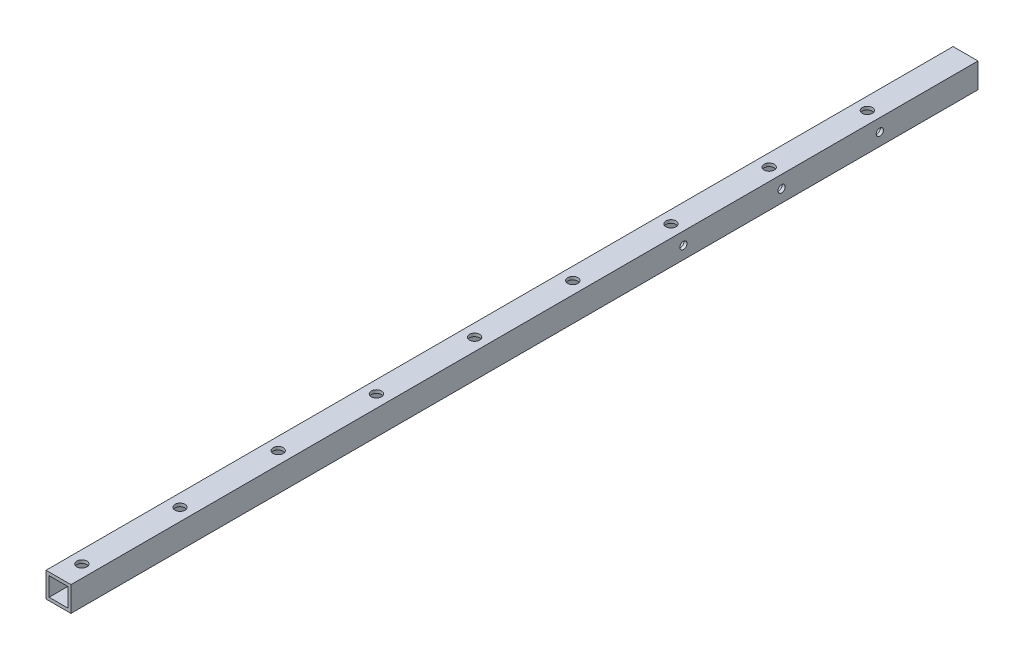
ISO-10303-21;
HEADER;
FILE_DESCRIPTION(('STEP AP214'),'2;1');
FILE_NAME('part.step','',(''),(''),'','','');
FILE_SCHEMA(('AUTOMOTIVE_DESIGN { 1 0 10303 214 1 1 1 1 }'));
ENDSEC;
DATA;
#1=APPLICATION_CONTEXT('core data for automotive mechanical design processes');
#2=APPLICATION_PROTOCOL_DEFINITION('international standard','automotive_design',2000,#1);
#3=PRODUCT_CONTEXT('',#1,'mechanical');
#4=PRODUCT('Part','Part','',(#3));
#5=PRODUCT_RELATED_PRODUCT_CATEGORY('part','',(#4));
#6=PRODUCT_DEFINITION_FORMATION('','',#4);
#7=PRODUCT_DEFINITION_CONTEXT('part definition',#1,'design');
#8=PRODUCT_DEFINITION('design','',#6,#7);
#9=PRODUCT_DEFINITION_SHAPE('','',#8);
#10=(LENGTH_UNIT() NAMED_UNIT(*) SI_UNIT(.MILLI.,.METRE.));
#11=(NAMED_UNIT(*) PLANE_ANGLE_UNIT() SI_UNIT($,.RADIAN.));
#12=(NAMED_UNIT(*) SI_UNIT($,.STERADIAN.) SOLID_ANGLE_UNIT());
#13=UNCERTAINTY_MEASURE_WITH_UNIT(LENGTH_MEASURE(1.E-05),#10,'distance_accuracy_value','');
#14=(GEOMETRIC_REPRESENTATION_CONTEXT(3) GLOBAL_UNCERTAINTY_ASSIGNED_CONTEXT((#13)) GLOBAL_UNIT_ASSIGNED_CONTEXT((#10,
#11,#12)) REPRESENTATION_CONTEXT('',''));
#15=CARTESIAN_POINT('',(0.,0.,0.));
#16=DIRECTION('',(0.,0.,1.));
#17=DIRECTION('',(1.,0.,0.));
#18=AXIS2_PLACEMENT_3D('',#15,#16,#17);
#19=CARTESIAN_POINT('',(-12.7,-12.7,923.8));
#20=DIRECTION('',(0.,0.,1.));
#21=DIRECTION('',(1.,0.,0.));
#22=AXIS2_PLACEMENT_3D('',#19,#20,#21);
#23=PLANE('',#22);
#24=DIRECTION('',(0.,-1.,0.));
#25=VECTOR('',#24,1.);
#26=CARTESIAN_POINT('',(-12.7,12.7,923.8));
#27=LINE('',#26,#25);
#28=CARTESIAN_POINT('',(-12.7,12.7,923.8));
#29=VERTEX_POINT('',#28);
#30=CARTESIAN_POINT('',(-12.7,-12.7,923.8));
#31=VERTEX_POINT('',#30);
#32=EDGE_CURVE('E138',#29,#31,#27,.T.);
#33=ORIENTED_EDGE('',*,*,#32,.T.);
#34=DIRECTION('',(1.,0.,0.));
#35=VECTOR('',#34,1.);
#36=CARTESIAN_POINT('',(-12.7,-12.7,923.8));
#37=LINE('',#36,#35);
#38=CARTESIAN_POINT('',(12.7,-12.7,923.8));
#39=VERTEX_POINT('',#38);
#40=EDGE_CURVE('E141',#31,#39,#37,.T.);
#41=ORIENTED_EDGE('',*,*,#40,.T.);
#42=DIRECTION('',(0.,1.,0.));
#43=VECTOR('',#42,1.);
#44=CARTESIAN_POINT('',(12.7,12.7,923.8));
#45=LINE('',#44,#43);
#46=CARTESIAN_POINT('',(12.7,12.7,923.8));
#47=VERTEX_POINT('',#46);
#48=EDGE_CURVE('E144',#39,#47,#45,.T.);
#49=ORIENTED_EDGE('',*,*,#48,.T.);
#50=DIRECTION('',(-1.,0.,0.));
#51=VECTOR('',#50,1.);
#52=CARTESIAN_POINT('',(-12.7,12.7,923.8));
#53=LINE('',#52,#51);
#54=EDGE_CURVE('E146',#47,#29,#53,.T.);
#55=ORIENTED_EDGE('',*,*,#54,.T.);
#56=EDGE_LOOP('',(#33,#41,#49,#55));
#57=FACE_BOUND('',#56,.T.);
#58=DIRECTION('',(1.,0.,0.));
#59=VECTOR('',#58,1.);
#60=CARTESIAN_POINT('',(-9.525,-9.525,923.8));
#61=LINE('',#60,#59);
#62=CARTESIAN_POINT('',(-9.525,-9.525,923.8));
#63=VERTEX_POINT('',#62);
#64=CARTESIAN_POINT('',(9.525,-9.525,923.8));
#65=VERTEX_POINT('',#64);
#66=EDGE_CURVE('E108',#63,#65,#61,.T.);
#67=ORIENTED_EDGE('',*,*,#66,.F.);
#68=DIRECTION('',(0.,-1.,0.));
#69=VECTOR('',#68,1.);
#70=CARTESIAN_POINT('',(-9.525,9.525,923.8));
#71=LINE('',#70,#69);
#72=CARTESIAN_POINT('',(-9.525,9.525,923.8));
#73=VERTEX_POINT('',#72);
#74=EDGE_CURVE('E100',#73,#63,#71,.T.);
#75=ORIENTED_EDGE('',*,*,#74,.F.);
#76=DIRECTION('',(-1.,0.,0.));
#77=VECTOR('',#76,1.);
#78=CARTESIAN_POINT('',(-9.525,9.525,923.8));
#79=LINE('',#78,#77);
#80=CARTESIAN_POINT('',(9.525,9.525,923.8));
#81=VERTEX_POINT('',#80);
#82=EDGE_CURVE('E122',#81,#73,#79,.T.);
#83=ORIENTED_EDGE('',*,*,#82,.F.);
#84=DIRECTION('',(0.,1.,0.));
#85=VECTOR('',#84,1.);
#86=CARTESIAN_POINT('',(9.525,9.525,923.8));
#87=LINE('',#86,#85);
#88=EDGE_CURVE('E120',#65,#81,#87,.T.);
#89=ORIENTED_EDGE('',*,*,#88,.F.);
#90=EDGE_LOOP('',(#67,#75,#83,#89));
#91=FACE_BOUND('',#90,.T.);
#92=ADVANCED_FACE('F33',(#57,#91),#23,.T.);
#93=CARTESIAN_POINT('',(-12.7,-12.7,0.));
#94=DIRECTION('',(0.,0.,1.));
#95=DIRECTION('',(1.,0.,0.));
#96=AXIS2_PLACEMENT_3D('',#93,#94,#95);
#97=PLANE('',#96);
#98=DIRECTION('',(0.,-1.,0.));
#99=VECTOR('',#98,1.);
#100=CARTESIAN_POINT('',(-12.7,12.7,0.));
#101=LINE('',#100,#99);
#102=CARTESIAN_POINT('',(-12.7,12.7,0.));
#103=VERTEX_POINT('',#102);
#104=CARTESIAN_POINT('',(-12.7,-12.7,0.));
#105=VERTEX_POINT('',#104);
#106=EDGE_CURVE('E116',#103,#105,#101,.T.);
#107=ORIENTED_EDGE('',*,*,#106,.F.);
#108=DIRECTION('',(-1.,0.,0.));
#109=VECTOR('',#108,1.);
#110=CARTESIAN_POINT('',(-12.7,12.7,0.));
#111=LINE('',#110,#109);
#112=CARTESIAN_POINT('',(12.7,12.7,0.));
#113=VERTEX_POINT('',#112);
#114=EDGE_CURVE('E142',#113,#103,#111,.T.);
#115=ORIENTED_EDGE('',*,*,#114,.F.);
#116=DIRECTION('',(0.,1.,0.));
#117=VECTOR('',#116,1.);
#118=CARTESIAN_POINT('',(12.7,12.7,0.));
#119=LINE('',#118,#117);
#120=CARTESIAN_POINT('',(12.7,-12.7,0.));
#121=VERTEX_POINT('',#120);
#122=EDGE_CURVE('E153',#121,#113,#119,.T.);
#123=ORIENTED_EDGE('',*,*,#122,.F.);
#124=DIRECTION('',(1.,0.,0.));
#125=VECTOR('',#124,1.);
#126=CARTESIAN_POINT('',(-12.7,-12.7,0.));
#127=LINE('',#126,#125);
#128=EDGE_CURVE('E151',#105,#121,#127,.T.);
#129=ORIENTED_EDGE('',*,*,#128,.F.);
#130=EDGE_LOOP('',(#107,#115,#123,#129));
#131=FACE_BOUND('',#130,.T.);
#132=DIRECTION('',(0.,-1.,0.));
#133=VECTOR('',#132,1.);
#134=CARTESIAN_POINT('',(-9.525,9.525,0.));
#135=LINE('',#134,#133);
#136=CARTESIAN_POINT('',(-9.525,9.525,0.));
#137=VERTEX_POINT('',#136);
#138=CARTESIAN_POINT('',(-9.525,-9.525,0.));
#139=VERTEX_POINT('',#138);
#140=EDGE_CURVE('E58',#137,#139,#135,.T.);
#141=ORIENTED_EDGE('',*,*,#140,.T.);
#142=DIRECTION('',(1.,0.,0.));
#143=VECTOR('',#142,1.);
#144=CARTESIAN_POINT('',(-9.525,-9.525,0.));
#145=LINE('',#144,#143);
#146=CARTESIAN_POINT('',(9.525,-9.525,0.));
#147=VERTEX_POINT('',#146);
#148=EDGE_CURVE('E115',#139,#147,#145,.T.);
#149=ORIENTED_EDGE('',*,*,#148,.T.);
#150=DIRECTION('',(0.,1.,0.));
#151=VECTOR('',#150,1.);
#152=CARTESIAN_POINT('',(9.525,9.525,0.));
#153=LINE('',#152,#151);
#154=CARTESIAN_POINT('',(9.525,9.525,0.));
#155=VERTEX_POINT('',#154);
#156=EDGE_CURVE('E130',#147,#155,#153,.T.);
#157=ORIENTED_EDGE('',*,*,#156,.T.);
#158=DIRECTION('',(-1.,0.,0.));
#159=VECTOR('',#158,1.);
#160=CARTESIAN_POINT('',(-9.525,9.525,0.));
#161=LINE('',#160,#159);
#162=EDGE_CURVE('E109',#155,#137,#161,.T.);
#163=ORIENTED_EDGE('',*,*,#162,.T.);
#164=EDGE_LOOP('',(#141,#149,#157,#163));
#165=FACE_BOUND('',#164,.T.);
#166=ADVANCED_FACE('F320',(#131,#165),#97,.F.);
#167=CARTESIAN_POINT('',(-12.7,12.7,923.8));
#168=DIRECTION('',(1.,0.,0.));
#169=DIRECTION('',(0.,1.,0.));
#170=AXIS2_PLACEMENT_3D('',#167,#168,#169);
#171=PLANE('',#170);
#172=CARTESIAN_POINT('',(-12.7,0.,300.));
#173=DIRECTION('',(-1.,0.,0.));
#174=DIRECTION('',(0.,-1.,0.));
#175=AXIS2_PLACEMENT_3D('',#172,#173,#174);
#176=CIRCLE('',#175,3.675);
#177=CARTESIAN_POINT('',(-12.7,-3.675,300.));
#178=VERTEX_POINT('',#177);
#179=EDGE_CURVE('E452',#178,#178,#176,.T.);
#180=ORIENTED_EDGE('',*,*,#179,.F.);
#181=EDGE_LOOP('',(#180));
#182=FACE_BOUND('',#181,.T.);
#183=CARTESIAN_POINT('',(-12.7,0.,200.));
#184=DIRECTION('',(-1.,0.,0.));
#185=DIRECTION('',(0.,-1.,0.));
#186=AXIS2_PLACEMENT_3D('',#183,#184,#185);
#187=CIRCLE('',#186,3.675);
#188=CARTESIAN_POINT('',(-12.7,-3.675,200.));
#189=VERTEX_POINT('',#188);
#190=EDGE_CURVE('E221',#189,#189,#187,.T.);
#191=ORIENTED_EDGE('',*,*,#190,.F.);
#192=EDGE_LOOP('',(#191));
#193=FACE_BOUND('',#192,.T.);
#194=CARTESIAN_POINT('',(-12.7,0.,100.));
#195=DIRECTION('',(-1.,0.,0.));
#196=DIRECTION('',(0.,-1.,0.));
#197=AXIS2_PLACEMENT_3D('',#194,#195,#196);
#198=CIRCLE('',#197,3.675);
#199=CARTESIAN_POINT('',(-12.7,-3.675,100.));
#200=VERTEX_POINT('',#199);
#201=EDGE_CURVE('E218',#200,#200,#198,.T.);
#202=ORIENTED_EDGE('',*,*,#201,.F.);
#203=EDGE_LOOP('',(#202));
#204=FACE_BOUND('',#203,.T.);
#205=ORIENTED_EDGE('',*,*,#106,.T.);
#206=DIRECTION('',(0.,0.,-1.));
#207=VECTOR('',#206,1.);
#208=CARTESIAN_POINT('',(-12.7,-12.7,923.8));
#209=LINE('',#208,#207);
#210=EDGE_CURVE('E11',#31,#105,#209,.T.);
#211=ORIENTED_EDGE('',*,*,#210,.F.);
#212=ORIENTED_EDGE('',*,*,#32,.F.);
#213=DIRECTION('',(0.,0.,-1.));
#214=VECTOR('',#213,1.);
#215=CARTESIAN_POINT('',(-12.7,12.7,923.8));
#216=LINE('',#215,#214);
#217=EDGE_CURVE('E148',#29,#103,#216,.T.);
#218=ORIENTED_EDGE('',*,*,#217,.T.);
#219=EDGE_LOOP('',(#205,#211,#212,#218));
#220=FACE_BOUND('',#219,.T.);
#221=ADVANCED_FACE('F35',(#182,#193,#204,#220),#171,.F.);
#222=CARTESIAN_POINT('',(-12.7,-12.7,923.8));
#223=DIRECTION('',(0.,1.,0.));
#224=DIRECTION('',(0.,0.,1.));
#225=AXIS2_PLACEMENT_3D('',#222,#223,#224);
#226=PLANE('',#225);
#227=CARTESIAN_POINT('',(8.37955521322352E-12,-12.7,900.));
#228=DIRECTION('',(0.,1.,0.));
#229=DIRECTION('',(0.,0.,1.));
#230=AXIS2_PLACEMENT_3D('',#227,#228,#229);
#231=CIRCLE('',#230,5.175);
#232=CARTESIAN_POINT('',(8.37955521322352E-12,-12.7,905.175));
#233=VERTEX_POINT('',#232);
#234=EDGE_CURVE('E206',#233,#233,#231,.T.);
#235=ORIENTED_EDGE('',*,*,#234,.T.);
#236=EDGE_LOOP('',(#235));
#237=FACE_BOUND('',#236,.T.);
#238=CARTESIAN_POINT('',(7.33211081157058E-12,-12.7,800.));
#239=DIRECTION('',(0.,1.,0.));
#240=DIRECTION('',(0.,0.,1.));
#241=AXIS2_PLACEMENT_3D('',#238,#239,#240);
#242=CIRCLE('',#241,5.175);
#243=CARTESIAN_POINT('',(7.33211081157058E-12,-12.7,805.175));
#244=VERTEX_POINT('',#243);
#245=EDGE_CURVE('E201',#244,#244,#242,.T.);
#246=ORIENTED_EDGE('',*,*,#245,.T.);
#247=EDGE_LOOP('',(#246));
#248=FACE_BOUND('',#247,.T.);
#249=CARTESIAN_POINT('',(6.28466640991764E-12,-12.7,700.));
#250=DIRECTION('',(0.,1.,0.));
#251=DIRECTION('',(0.,0.,1.));
#252=AXIS2_PLACEMENT_3D('',#249,#250,#251);
#253=CIRCLE('',#252,5.175);
#254=CARTESIAN_POINT('',(6.28466640991764E-12,-12.7,705.175));
#255=VERTEX_POINT('',#254);
#256=EDGE_CURVE('E196',#255,#255,#253,.T.);
#257=ORIENTED_EDGE('',*,*,#256,.T.);
#258=EDGE_LOOP('',(#257));
#259=FACE_BOUND('',#258,.T.);
#260=CARTESIAN_POINT('',(5.2372220082647E-12,-12.7,600.));
#261=DIRECTION('',(0.,1.,0.));
#262=DIRECTION('',(0.,0.,1.));
#263=AXIS2_PLACEMENT_3D('',#260,#261,#262);
#264=CIRCLE('',#263,5.175);
#265=CARTESIAN_POINT('',(5.2372220082647E-12,-12.7,605.175));
#266=VERTEX_POINT('',#265);
#267=EDGE_CURVE('E191',#266,#266,#264,.T.);
#268=ORIENTED_EDGE('',*,*,#267,.T.);
#269=EDGE_LOOP('',(#268));
#270=FACE_BOUND('',#269,.T.);
#271=CARTESIAN_POINT('',(4.18977760661176E-12,-12.7,500.));
#272=DIRECTION('',(0.,1.,0.));
#273=DIRECTION('',(0.,0.,1.));
#274=AXIS2_PLACEMENT_3D('',#271,#272,#273);
#275=CIRCLE('',#274,5.175);
#276=CARTESIAN_POINT('',(4.18977760661176E-12,-12.7,505.175));
#277=VERTEX_POINT('',#276);
#278=EDGE_CURVE('E186',#277,#277,#275,.T.);
#279=ORIENTED_EDGE('',*,*,#278,.T.);
#280=EDGE_LOOP('',(#279));
#281=FACE_BOUND('',#280,.T.);
#282=CARTESIAN_POINT('',(3.14233320495882E-12,-12.7,400.));
#283=DIRECTION('',(0.,1.,0.));
#284=DIRECTION('',(0.,0.,1.));
#285=AXIS2_PLACEMENT_3D('',#282,#283,#284);
#286=CIRCLE('',#285,5.175);
#287=CARTESIAN_POINT('',(3.14233320495882E-12,-12.7,405.175));
#288=VERTEX_POINT('',#287);
#289=EDGE_CURVE('E181',#288,#288,#286,.T.);
#290=ORIENTED_EDGE('',*,*,#289,.T.);
#291=EDGE_LOOP('',(#290));
#292=FACE_BOUND('',#291,.T.);
#293=CARTESIAN_POINT('',(2.09488880330588E-12,-12.7,300.));
#294=DIRECTION('',(0.,1.,0.));
#295=DIRECTION('',(0.,0.,1.));
#296=AXIS2_PLACEMENT_3D('',#293,#294,#295);
#297=CIRCLE('',#296,5.175);
#298=CARTESIAN_POINT('',(2.09488880330588E-12,-12.7,305.175));
#299=VERTEX_POINT('',#298);
#300=EDGE_CURVE('E176',#299,#299,#297,.T.);
#301=ORIENTED_EDGE('',*,*,#300,.T.);
#302=EDGE_LOOP('',(#301));
#303=FACE_BOUND('',#302,.T.);
#304=CARTESIAN_POINT('',(1.04744440165294E-12,-12.7,200.));
#305=DIRECTION('',(0.,1.,0.));
#306=DIRECTION('',(0.,0.,1.));
#307=AXIS2_PLACEMENT_3D('',#304,#305,#306);
#308=CIRCLE('',#307,5.175);
#309=CARTESIAN_POINT('',(1.04744440165294E-12,-12.7,205.175));
#310=VERTEX_POINT('',#309);
#311=EDGE_CURVE('E171',#310,#310,#308,.T.);
#312=ORIENTED_EDGE('',*,*,#311,.T.);
#313=EDGE_LOOP('',(#312));
#314=FACE_BOUND('',#313,.T.);
#315=CARTESIAN_POINT('',(0.,-12.7,100.));
#316=DIRECTION('',(0.,1.,0.));
#317=DIRECTION('',(0.,0.,1.));
#318=AXIS2_PLACEMENT_3D('',#315,#316,#317);
#319=CIRCLE('',#318,5.175);
#320=CARTESIAN_POINT('',(0.,-12.7,105.175));
#321=VERTEX_POINT('',#320);
#322=EDGE_CURVE('E166',#321,#321,#319,.T.);
#323=ORIENTED_EDGE('',*,*,#322,.T.);
#324=EDGE_LOOP('',(#323));
#325=FACE_BOUND('',#324,.T.);
#326=ORIENTED_EDGE('',*,*,#128,.T.);
#327=DIRECTION('',(0.,0.,-1.));
#328=VECTOR('',#327,1.);
#329=CARTESIAN_POINT('',(12.7,-12.7,923.8));
#330=LINE('',#329,#328);
#331=EDGE_CURVE('E42',#39,#121,#330,.T.);
#332=ORIENTED_EDGE('',*,*,#331,.F.);
#333=ORIENTED_EDGE('',*,*,#40,.F.);
#334=ORIENTED_EDGE('',*,*,#210,.T.);
#335=EDGE_LOOP('',(#326,#332,#333,#334));
#336=FACE_BOUND('',#335,.T.);
#337=ADVANCED_FACE('F334',(#237,#248,#259,#270,#281,#292,#303,#314,#325,#336),#226,.F.);
#338=CARTESIAN_POINT('',(12.7,12.7,923.8));
#339=DIRECTION('',(-1.,0.,0.));
#340=DIRECTION('',(0.,-1.,0.));
#341=AXIS2_PLACEMENT_3D('',#338,#339,#340);
#342=PLANE('',#341);
#343=CARTESIAN_POINT('',(12.7,0.,300.));
#344=DIRECTION('',(-1.,0.,0.));
#345=DIRECTION('',(0.,-1.,0.));
#346=AXIS2_PLACEMENT_3D('',#343,#344,#345);
#347=CIRCLE('',#346,3.675);
#348=CARTESIAN_POINT('',(12.7,-3.67499999999999,300.));
#349=VERTEX_POINT('',#348);
#350=EDGE_CURVE('E451',#349,#349,#347,.T.);
#351=ORIENTED_EDGE('',*,*,#350,.T.);
#352=EDGE_LOOP('',(#351));
#353=FACE_BOUND('',#352,.T.);
#354=CARTESIAN_POINT('',(12.7,0.,200.));
#355=DIRECTION('',(-1.,0.,0.));
#356=DIRECTION('',(0.,-1.,0.));
#357=AXIS2_PLACEMENT_3D('',#354,#355,#356);
#358=CIRCLE('',#357,3.675);
#359=CARTESIAN_POINT('',(12.7,-3.67499999999999,200.));
#360=VERTEX_POINT('',#359);
#361=EDGE_CURVE('E214',#360,#360,#358,.T.);
#362=ORIENTED_EDGE('',*,*,#361,.T.);
#363=EDGE_LOOP('',(#362));
#364=FACE_BOUND('',#363,.T.);
#365=CARTESIAN_POINT('',(12.7,0.,100.));
#366=DIRECTION('',(-1.,0.,0.));
#367=DIRECTION('',(0.,-1.,0.));
#368=AXIS2_PLACEMENT_3D('',#365,#366,#367);
#369=CIRCLE('',#368,3.675);
#370=CARTESIAN_POINT('',(12.7,-3.67499999999999,100.));
#371=VERTEX_POINT('',#370);
#372=EDGE_CURVE('E210',#371,#371,#369,.T.);
#373=ORIENTED_EDGE('',*,*,#372,.T.);
#374=EDGE_LOOP('',(#373));
#375=FACE_BOUND('',#374,.T.);
#376=ORIENTED_EDGE('',*,*,#122,.T.);
#377=DIRECTION('',(0.,0.,-1.));
#378=VECTOR('',#377,1.);
#379=CARTESIAN_POINT('',(12.7,12.7,923.8));
#380=LINE('',#379,#378);
#381=EDGE_CURVE('E158',#47,#113,#380,.T.);
#382=ORIENTED_EDGE('',*,*,#381,.F.);
#383=ORIENTED_EDGE('',*,*,#48,.F.);
#384=ORIENTED_EDGE('',*,*,#331,.T.);
#385=EDGE_LOOP('',(#376,#382,#383,#384));
#386=FACE_BOUND('',#385,.T.);
#387=ADVANCED_FACE('F331',(#353,#364,#375,#386),#342,.F.);
#388=CARTESIAN_POINT('',(-12.7,12.7,923.8));
#389=DIRECTION('',(0.,-1.,0.));
#390=DIRECTION('',(0.,0.,-1.));
#391=AXIS2_PLACEMENT_3D('',#388,#389,#390);
#392=PLANE('',#391);
#393=CARTESIAN_POINT('',(8.37955521322352E-12,12.7,900.));
#394=DIRECTION('',(0.,1.,0.));
#395=DIRECTION('',(0.,0.,1.));
#396=AXIS2_PLACEMENT_3D('',#393,#394,#395);
#397=CIRCLE('',#396,5.175);
#398=CARTESIAN_POINT('',(8.37955521322352E-12,12.7,905.175));
#399=VERTEX_POINT('',#398);
#400=EDGE_CURVE('E237',#399,#399,#397,.T.);
#401=ORIENTED_EDGE('',*,*,#400,.F.);
#402=EDGE_LOOP('',(#401));
#403=FACE_BOUND('',#402,.T.);
#404=CARTESIAN_POINT('',(7.33211081157058E-12,12.7,800.));
#405=DIRECTION('',(0.,1.,0.));
#406=DIRECTION('',(0.,0.,1.));
#407=AXIS2_PLACEMENT_3D('',#404,#405,#406);
#408=CIRCLE('',#407,5.175);
#409=CARTESIAN_POINT('',(7.33211081157058E-12,12.7,805.175));
#410=VERTEX_POINT('',#409);
#411=EDGE_CURVE('E244',#410,#410,#408,.T.);
#412=ORIENTED_EDGE('',*,*,#411,.F.);
#413=EDGE_LOOP('',(#412));
#414=FACE_BOUND('',#413,.T.);
#415=CARTESIAN_POINT('',(6.28466640991764E-12,12.7,700.));
#416=DIRECTION('',(0.,1.,0.));
#417=DIRECTION('',(0.,0.,1.));
#418=AXIS2_PLACEMENT_3D('',#415,#416,#417);
#419=CIRCLE('',#418,5.175);
#420=CARTESIAN_POINT('',(6.28466640991764E-12,12.7,705.175));
#421=VERTEX_POINT('',#420);
#422=EDGE_CURVE('E251',#421,#421,#419,.T.);
#423=ORIENTED_EDGE('',*,*,#422,.F.);
#424=EDGE_LOOP('',(#423));
#425=FACE_BOUND('',#424,.T.);
#426=CARTESIAN_POINT('',(5.2372220082647E-12,12.7,600.));
#427=DIRECTION('',(0.,1.,0.));
#428=DIRECTION('',(0.,0.,1.));
#429=AXIS2_PLACEMENT_3D('',#426,#427,#428);
#430=CIRCLE('',#429,5.175);
#431=CARTESIAN_POINT('',(5.2372220082647E-12,12.7,605.175));
#432=VERTEX_POINT('',#431);
#433=EDGE_CURVE('E258',#432,#432,#430,.T.);
#434=ORIENTED_EDGE('',*,*,#433,.F.);
#435=EDGE_LOOP('',(#434));
#436=FACE_BOUND('',#435,.T.);
#437=CARTESIAN_POINT('',(4.18977760661176E-12,12.7,500.));
#438=DIRECTION('',(0.,1.,0.));
#439=DIRECTION('',(0.,0.,1.));
#440=AXIS2_PLACEMENT_3D('',#437,#438,#439);
#441=CIRCLE('',#440,5.175);
#442=CARTESIAN_POINT('',(4.18977760661176E-12,12.7,505.175));
#443=VERTEX_POINT('',#442);
#444=EDGE_CURVE('E265',#443,#443,#441,.T.);
#445=ORIENTED_EDGE('',*,*,#444,.F.);
#446=EDGE_LOOP('',(#445));
#447=FACE_BOUND('',#446,.T.);
#448=CARTESIAN_POINT('',(3.14233320495882E-12,12.7,400.));
#449=DIRECTION('',(0.,1.,0.));
#450=DIRECTION('',(0.,0.,1.));
#451=AXIS2_PLACEMENT_3D('',#448,#449,#450);
#452=CIRCLE('',#451,5.175);
#453=CARTESIAN_POINT('',(3.14233320495882E-12,12.7,405.175));
#454=VERTEX_POINT('',#453);
#455=EDGE_CURVE('E272',#454,#454,#452,.T.);
#456=ORIENTED_EDGE('',*,*,#455,.F.);
#457=EDGE_LOOP('',(#456));
#458=FACE_BOUND('',#457,.T.);
#459=CARTESIAN_POINT('',(2.09488880330588E-12,12.7,300.));
#460=DIRECTION('',(0.,1.,0.));
#461=DIRECTION('',(0.,0.,1.));
#462=AXIS2_PLACEMENT_3D('',#459,#460,#461);
#463=CIRCLE('',#462,5.175);
#464=CARTESIAN_POINT('',(2.09488880330588E-12,12.7,305.175));
#465=VERTEX_POINT('',#464);
#466=EDGE_CURVE('E279',#465,#465,#463,.T.);
#467=ORIENTED_EDGE('',*,*,#466,.F.);
#468=EDGE_LOOP('',(#467));
#469=FACE_BOUND('',#468,.T.);
#470=CARTESIAN_POINT('',(1.04744440165294E-12,12.7,200.));
#471=DIRECTION('',(0.,1.,0.));
#472=DIRECTION('',(0.,0.,1.));
#473=AXIS2_PLACEMENT_3D('',#470,#471,#472);
#474=CIRCLE('',#473,5.175);
#475=CARTESIAN_POINT('',(1.04744440165294E-12,12.7,205.175));
#476=VERTEX_POINT('',#475);
#477=EDGE_CURVE('E286',#476,#476,#474,.T.);
#478=ORIENTED_EDGE('',*,*,#477,.F.);
#479=EDGE_LOOP('',(#478));
#480=FACE_BOUND('',#479,.T.);
#481=CARTESIAN_POINT('',(0.,12.7,100.));
#482=DIRECTION('',(0.,1.,0.));
#483=DIRECTION('',(0.,0.,1.));
#484=AXIS2_PLACEMENT_3D('',#481,#482,#483);
#485=CIRCLE('',#484,5.175);
#486=CARTESIAN_POINT('',(0.,12.7,105.175));
#487=VERTEX_POINT('',#486);
#488=EDGE_CURVE('E293',#487,#487,#485,.T.);
#489=ORIENTED_EDGE('',*,*,#488,.F.);
#490=EDGE_LOOP('',(#489));
#491=FACE_BOUND('',#490,.T.);
#492=ORIENTED_EDGE('',*,*,#114,.T.);
#493=ORIENTED_EDGE('',*,*,#217,.F.);
#494=ORIENTED_EDGE('',*,*,#54,.F.);
#495=ORIENTED_EDGE('',*,*,#381,.T.);
#496=EDGE_LOOP('',(#492,#493,#494,#495));
#497=FACE_BOUND('',#496,.T.);
#498=ADVANCED_FACE('F314',(#403,#414,#425,#436,#447,#458,#469,#480,#491,#497),#392,.F.);
#499=CARTESIAN_POINT('',(-9.525,9.525,923.8));
#500=DIRECTION('',(1.,0.,0.));
#501=DIRECTION('',(0.,1.,0.));
#502=AXIS2_PLACEMENT_3D('',#499,#500,#501);
#503=PLANE('',#502);
#504=CARTESIAN_POINT('',(-9.525,0.,300.));
#505=DIRECTION('',(1.,0.,0.));
#506=DIRECTION('',(0.,1.,0.));
#507=AXIS2_PLACEMENT_3D('',#504,#505,#506);
#508=CIRCLE('',#507,3.675);
#509=CARTESIAN_POINT('',(-9.525,3.675,300.));
#510=VERTEX_POINT('',#509);
#511=EDGE_CURVE('E226',#510,#510,#508,.T.);
#512=ORIENTED_EDGE('',*,*,#511,.F.);
#513=EDGE_LOOP('',(#512));
#514=FACE_BOUND('',#513,.T.);
#515=CARTESIAN_POINT('',(-9.525,0.,200.));
#516=DIRECTION('',(1.,0.,0.));
#517=DIRECTION('',(0.,1.,0.));
#518=AXIS2_PLACEMENT_3D('',#515,#516,#517);
#519=CIRCLE('',#518,3.675);
#520=CARTESIAN_POINT('',(-9.525,3.675,200.));
#521=VERTEX_POINT('',#520);
#522=EDGE_CURVE('E213',#521,#521,#519,.T.);
#523=ORIENTED_EDGE('',*,*,#522,.F.);
#524=EDGE_LOOP('',(#523));
#525=FACE_BOUND('',#524,.T.);
#526=CARTESIAN_POINT('',(-9.525,0.,100.));
#527=DIRECTION('',(1.,0.,0.));
#528=DIRECTION('',(0.,1.,0.));
#529=AXIS2_PLACEMENT_3D('',#526,#527,#528);
#530=CIRCLE('',#529,3.675);
#531=CARTESIAN_POINT('',(-9.525,3.675,100.));
#532=VERTEX_POINT('',#531);
#533=EDGE_CURVE('E209',#532,#532,#530,.T.);
#534=ORIENTED_EDGE('',*,*,#533,.F.);
#535=EDGE_LOOP('',(#534));
#536=FACE_BOUND('',#535,.T.);
#537=ORIENTED_EDGE('',*,*,#140,.F.);
#538=DIRECTION('',(0.,0.,-1.));
#539=VECTOR('',#538,1.);
#540=CARTESIAN_POINT('',(-9.525,9.525,923.8));
#541=LINE('',#540,#539);
#542=EDGE_CURVE('E104',#73,#137,#541,.T.);
#543=ORIENTED_EDGE('',*,*,#542,.F.);
#544=ORIENTED_EDGE('',*,*,#74,.T.);
#545=DIRECTION('',(0.,0.,-1.));
#546=VECTOR('',#545,1.);
#547=CARTESIAN_POINT('',(-9.525,-9.525,923.8));
#548=LINE('',#547,#546);
#549=EDGE_CURVE('E103',#63,#139,#548,.T.);
#550=ORIENTED_EDGE('',*,*,#549,.T.);
#551=EDGE_LOOP('',(#537,#543,#544,#550));
#552=FACE_BOUND('',#551,.T.);
#553=ADVANCED_FACE('F102',(#514,#525,#536,#552),#503,.T.);
#554=CARTESIAN_POINT('',(-9.525,-9.525,923.8));
#555=DIRECTION('',(0.,1.,0.));
#556=DIRECTION('',(0.,0.,1.));
#557=AXIS2_PLACEMENT_3D('',#554,#555,#556);
#558=PLANE('',#557);
#559=CARTESIAN_POINT('',(8.37955521322352E-12,-9.525,900.));
#560=DIRECTION('',(0.,1.,0.));
#561=DIRECTION('',(0.,0.,1.));
#562=AXIS2_PLACEMENT_3D('',#559,#560,#561);
#563=CIRCLE('',#562,5.175);
#564=CARTESIAN_POINT('',(8.37955521322352E-12,-9.525,905.175));
#565=VERTEX_POINT('',#564);
#566=EDGE_CURVE('E205',#565,#565,#563,.T.);
#567=ORIENTED_EDGE('',*,*,#566,.F.);
#568=EDGE_LOOP('',(#567));
#569=FACE_BOUND('',#568,.T.);
#570=CARTESIAN_POINT('',(7.33211081157058E-12,-9.525,800.));
#571=DIRECTION('',(0.,1.,0.));
#572=DIRECTION('',(0.,0.,1.));
#573=AXIS2_PLACEMENT_3D('',#570,#571,#572);
#574=CIRCLE('',#573,5.175);
#575=CARTESIAN_POINT('',(7.33211081157058E-12,-9.525,805.175));
#576=VERTEX_POINT('',#575);
#577=EDGE_CURVE('E200',#576,#576,#574,.T.);
#578=ORIENTED_EDGE('',*,*,#577,.F.);
#579=EDGE_LOOP('',(#578));
#580=FACE_BOUND('',#579,.T.);
#581=CARTESIAN_POINT('',(6.28466640991764E-12,-9.525,700.));
#582=DIRECTION('',(0.,1.,0.));
#583=DIRECTION('',(0.,0.,1.));
#584=AXIS2_PLACEMENT_3D('',#581,#582,#583);
#585=CIRCLE('',#584,5.175);
#586=CARTESIAN_POINT('',(6.28466640991764E-12,-9.525,705.175));
#587=VERTEX_POINT('',#586);
#588=EDGE_CURVE('E195',#587,#587,#585,.T.);
#589=ORIENTED_EDGE('',*,*,#588,.F.);
#590=EDGE_LOOP('',(#589));
#591=FACE_BOUND('',#590,.T.);
#592=CARTESIAN_POINT('',(5.2372220082647E-12,-9.525,600.));
#593=DIRECTION('',(0.,1.,0.));
#594=DIRECTION('',(0.,0.,1.));
#595=AXIS2_PLACEMENT_3D('',#592,#593,#594);
#596=CIRCLE('',#595,5.175);
#597=CARTESIAN_POINT('',(5.2372220082647E-12,-9.525,605.175));
#598=VERTEX_POINT('',#597);
#599=EDGE_CURVE('E190',#598,#598,#596,.T.);
#600=ORIENTED_EDGE('',*,*,#599,.F.);
#601=EDGE_LOOP('',(#600));
#602=FACE_BOUND('',#601,.T.);
#603=CARTESIAN_POINT('',(4.18977760661176E-12,-9.525,500.));
#604=DIRECTION('',(0.,1.,0.));
#605=DIRECTION('',(0.,0.,1.));
#606=AXIS2_PLACEMENT_3D('',#603,#604,#605);
#607=CIRCLE('',#606,5.175);
#608=CARTESIAN_POINT('',(4.18977760661176E-12,-9.525,505.175));
#609=VERTEX_POINT('',#608);
#610=EDGE_CURVE('E185',#609,#609,#607,.T.);
#611=ORIENTED_EDGE('',*,*,#610,.F.);
#612=EDGE_LOOP('',(#611));
#613=FACE_BOUND('',#612,.T.);
#614=CARTESIAN_POINT('',(3.14233320495882E-12,-9.525,400.));
#615=DIRECTION('',(0.,1.,0.));
#616=DIRECTION('',(0.,0.,1.));
#617=AXIS2_PLACEMENT_3D('',#614,#615,#616);
#618=CIRCLE('',#617,5.175);
#619=CARTESIAN_POINT('',(3.14233320495882E-12,-9.525,405.175));
#620=VERTEX_POINT('',#619);
#621=EDGE_CURVE('E180',#620,#620,#618,.T.);
#622=ORIENTED_EDGE('',*,*,#621,.F.);
#623=EDGE_LOOP('',(#622));
#624=FACE_BOUND('',#623,.T.);
#625=CARTESIAN_POINT('',(2.09488880330588E-12,-9.525,300.));
#626=DIRECTION('',(0.,1.,0.));
#627=DIRECTION('',(0.,0.,1.));
#628=AXIS2_PLACEMENT_3D('',#625,#626,#627);
#629=CIRCLE('',#628,5.175);
#630=CARTESIAN_POINT('',(2.09488880330588E-12,-9.525,305.175));
#631=VERTEX_POINT('',#630);
#632=EDGE_CURVE('E175',#631,#631,#629,.T.);
#633=ORIENTED_EDGE('',*,*,#632,.F.);
#634=EDGE_LOOP('',(#633));
#635=FACE_BOUND('',#634,.T.);
#636=CARTESIAN_POINT('',(1.04744440165294E-12,-9.525,200.));
#637=DIRECTION('',(0.,1.,0.));
#638=DIRECTION('',(0.,0.,1.));
#639=AXIS2_PLACEMENT_3D('',#636,#637,#638);
#640=CIRCLE('',#639,5.175);
#641=CARTESIAN_POINT('',(1.04744440165294E-12,-9.525,205.175));
#642=VERTEX_POINT('',#641);
#643=EDGE_CURVE('E170',#642,#642,#640,.T.);
#644=ORIENTED_EDGE('',*,*,#643,.F.);
#645=EDGE_LOOP('',(#644));
#646=FACE_BOUND('',#645,.T.);
#647=CARTESIAN_POINT('',(0.,-9.525,100.));
#648=DIRECTION('',(0.,1.,0.));
#649=DIRECTION('',(0.,0.,1.));
#650=AXIS2_PLACEMENT_3D('',#647,#648,#649);
#651=CIRCLE('',#650,5.175);
#652=CARTESIAN_POINT('',(0.,-9.525,105.175));
#653=VERTEX_POINT('',#652);
#654=EDGE_CURVE('E128',#653,#653,#651,.T.);
#655=ORIENTED_EDGE('',*,*,#654,.F.);
#656=EDGE_LOOP('',(#655));
#657=FACE_BOUND('',#656,.T.);
#658=ORIENTED_EDGE('',*,*,#148,.F.);
#659=ORIENTED_EDGE('',*,*,#549,.F.);
#660=ORIENTED_EDGE('',*,*,#66,.T.);
#661=DIRECTION('',(0.,0.,-1.));
#662=VECTOR('',#661,1.);
#663=CARTESIAN_POINT('',(9.525,-9.525,923.8));
#664=LINE('',#663,#662);
#665=EDGE_CURVE('E117',#65,#147,#664,.T.);
#666=ORIENTED_EDGE('',*,*,#665,.T.);
#667=EDGE_LOOP('',(#658,#659,#660,#666));
#668=FACE_BOUND('',#667,.T.);
#669=ADVANCED_FACE('F112',(#569,#580,#591,#602,#613,#624,#635,#646,#657,#668),#558,.T.);
#670=CARTESIAN_POINT('',(9.525,9.525,923.8));
#671=DIRECTION('',(-1.,0.,0.));
#672=DIRECTION('',(0.,-1.,0.));
#673=AXIS2_PLACEMENT_3D('',#670,#671,#672);
#674=PLANE('',#673);
#675=CARTESIAN_POINT('',(9.525,0.,300.));
#676=DIRECTION('',(-1.,0.,0.));
#677=DIRECTION('',(0.,-1.,0.));
#678=AXIS2_PLACEMENT_3D('',#675,#676,#677);
#679=CIRCLE('',#678,3.675);
#680=CARTESIAN_POINT('',(9.525,-3.675,300.));
#681=VERTEX_POINT('',#680);
#682=EDGE_CURVE('E37',#681,#681,#679,.T.);
#683=ORIENTED_EDGE('',*,*,#682,.F.);
#684=EDGE_LOOP('',(#683));
#685=FACE_BOUND('',#684,.T.);
#686=CARTESIAN_POINT('',(9.525,0.,200.));
#687=DIRECTION('',(-1.,0.,0.));
#688=DIRECTION('',(0.,-1.,0.));
#689=AXIS2_PLACEMENT_3D('',#686,#687,#688);
#690=CIRCLE('',#689,3.675);
#691=CARTESIAN_POINT('',(9.525,-3.675,200.));
#692=VERTEX_POINT('',#691);
#693=EDGE_CURVE('E211',#692,#692,#690,.T.);
#694=ORIENTED_EDGE('',*,*,#693,.F.);
#695=EDGE_LOOP('',(#694));
#696=FACE_BOUND('',#695,.T.);
#697=CARTESIAN_POINT('',(9.525,0.,100.));
#698=DIRECTION('',(-1.,0.,0.));
#699=DIRECTION('',(0.,-1.,0.));
#700=AXIS2_PLACEMENT_3D('',#697,#698,#699);
#701=CIRCLE('',#700,3.675);
#702=CARTESIAN_POINT('',(9.525,-3.675,100.));
#703=VERTEX_POINT('',#702);
#704=EDGE_CURVE('E207',#703,#703,#701,.T.);
#705=ORIENTED_EDGE('',*,*,#704,.F.);
#706=EDGE_LOOP('',(#705));
#707=FACE_BOUND('',#706,.T.);
#708=ORIENTED_EDGE('',*,*,#156,.F.);
#709=ORIENTED_EDGE('',*,*,#665,.F.);
#710=ORIENTED_EDGE('',*,*,#88,.T.);
#711=DIRECTION('',(0.,0.,-1.));
#712=VECTOR('',#711,1.);
#713=CARTESIAN_POINT('',(9.525,9.525,923.8));
#714=LINE('',#713,#712);
#715=EDGE_CURVE('E50',#81,#155,#714,.T.);
#716=ORIENTED_EDGE('',*,*,#715,.T.);
#717=EDGE_LOOP('',(#708,#709,#710,#716));
#718=FACE_BOUND('',#717,.T.);
#719=ADVANCED_FACE('F304',(#685,#696,#707,#718),#674,.T.);
#720=CARTESIAN_POINT('',(-9.525,9.525,923.8));
#721=DIRECTION('',(0.,-1.,0.));
#722=DIRECTION('',(0.,0.,-1.));
#723=AXIS2_PLACEMENT_3D('',#720,#721,#722);
#724=PLANE('',#723);
#725=CARTESIAN_POINT('',(8.37955521322352E-12,9.525,900.));
#726=DIRECTION('',(0.,-1.,0.));
#727=DIRECTION('',(0.,0.,-1.));
#728=AXIS2_PLACEMENT_3D('',#725,#726,#727);
#729=CIRCLE('',#728,5.175);
#730=CARTESIAN_POINT('',(8.37955521322352E-12,9.525,894.825));
#731=VERTEX_POINT('',#730);
#732=EDGE_CURVE('E202',#731,#731,#729,.T.);
#733=ORIENTED_EDGE('',*,*,#732,.F.);
#734=EDGE_LOOP('',(#733));
#735=FACE_BOUND('',#734,.T.);
#736=CARTESIAN_POINT('',(7.33211081157058E-12,9.525,800.));
#737=DIRECTION('',(0.,-1.,0.));
#738=DIRECTION('',(0.,0.,-1.));
#739=AXIS2_PLACEMENT_3D('',#736,#737,#738);
#740=CIRCLE('',#739,5.175);
#741=CARTESIAN_POINT('',(7.33211081157058E-12,9.525,794.825));
#742=VERTEX_POINT('',#741);
#743=EDGE_CURVE('E197',#742,#742,#740,.T.);
#744=ORIENTED_EDGE('',*,*,#743,.F.);
#745=EDGE_LOOP('',(#744));
#746=FACE_BOUND('',#745,.T.);
#747=CARTESIAN_POINT('',(6.28466640991764E-12,9.525,700.));
#748=DIRECTION('',(0.,-1.,0.));
#749=DIRECTION('',(0.,0.,-1.));
#750=AXIS2_PLACEMENT_3D('',#747,#748,#749);
#751=CIRCLE('',#750,5.175);
#752=CARTESIAN_POINT('',(6.28466640991764E-12,9.525,694.825));
#753=VERTEX_POINT('',#752);
#754=EDGE_CURVE('E192',#753,#753,#751,.T.);
#755=ORIENTED_EDGE('',*,*,#754,.F.);
#756=EDGE_LOOP('',(#755));
#757=FACE_BOUND('',#756,.T.);
#758=CARTESIAN_POINT('',(5.2372220082647E-12,9.525,600.));
#759=DIRECTION('',(0.,-1.,0.));
#760=DIRECTION('',(0.,0.,-1.));
#761=AXIS2_PLACEMENT_3D('',#758,#759,#760);
#762=CIRCLE('',#761,5.175);
#763=CARTESIAN_POINT('',(5.2372220082647E-12,9.525,594.825));
#764=VERTEX_POINT('',#763);
#765=EDGE_CURVE('E187',#764,#764,#762,.T.);
#766=ORIENTED_EDGE('',*,*,#765,.F.);
#767=EDGE_LOOP('',(#766));
#768=FACE_BOUND('',#767,.T.);
#769=CARTESIAN_POINT('',(4.18977760661176E-12,9.525,500.));
#770=DIRECTION('',(0.,-1.,0.));
#771=DIRECTION('',(0.,0.,-1.));
#772=AXIS2_PLACEMENT_3D('',#769,#770,#771);
#773=CIRCLE('',#772,5.175);
#774=CARTESIAN_POINT('',(4.18977760661176E-12,9.525,494.825));
#775=VERTEX_POINT('',#774);
#776=EDGE_CURVE('E182',#775,#775,#773,.T.);
#777=ORIENTED_EDGE('',*,*,#776,.F.);
#778=EDGE_LOOP('',(#777));
#779=FACE_BOUND('',#778,.T.);
#780=CARTESIAN_POINT('',(3.14233320495882E-12,9.525,400.));
#781=DIRECTION('',(0.,-1.,0.));
#782=DIRECTION('',(0.,0.,-1.));
#783=AXIS2_PLACEMENT_3D('',#780,#781,#782);
#784=CIRCLE('',#783,5.175);
#785=CARTESIAN_POINT('',(3.14233320495882E-12,9.525,394.825));
#786=VERTEX_POINT('',#785);
#787=EDGE_CURVE('E177',#786,#786,#784,.T.);
#788=ORIENTED_EDGE('',*,*,#787,.F.);
#789=EDGE_LOOP('',(#788));
#790=FACE_BOUND('',#789,.T.);
#791=CARTESIAN_POINT('',(2.09488880330588E-12,9.525,300.));
#792=DIRECTION('',(0.,-1.,0.));
#793=DIRECTION('',(0.,0.,-1.));
#794=AXIS2_PLACEMENT_3D('',#791,#792,#793);
#795=CIRCLE('',#794,5.175);
#796=CARTESIAN_POINT('',(2.09488880330588E-12,9.525,294.825));
#797=VERTEX_POINT('',#796);
#798=EDGE_CURVE('E172',#797,#797,#795,.T.);
#799=ORIENTED_EDGE('',*,*,#798,.F.);
#800=EDGE_LOOP('',(#799));
#801=FACE_BOUND('',#800,.T.);
#802=CARTESIAN_POINT('',(1.04744440165294E-12,9.525,200.));
#803=DIRECTION('',(0.,-1.,0.));
#804=DIRECTION('',(0.,0.,-1.));
#805=AXIS2_PLACEMENT_3D('',#802,#803,#804);
#806=CIRCLE('',#805,5.175);
#807=CARTESIAN_POINT('',(1.04744440165294E-12,9.525,194.825));
#808=VERTEX_POINT('',#807);
#809=EDGE_CURVE('E167',#808,#808,#806,.T.);
#810=ORIENTED_EDGE('',*,*,#809,.F.);
#811=EDGE_LOOP('',(#810));
#812=FACE_BOUND('',#811,.T.);
#813=CARTESIAN_POINT('',(0.,9.525,100.));
#814=DIRECTION('',(0.,-1.,0.));
#815=DIRECTION('',(0.,0.,-1.));
#816=AXIS2_PLACEMENT_3D('',#813,#814,#815);
#817=CIRCLE('',#816,5.175);
#818=CARTESIAN_POINT('',(0.,9.525,94.825));
#819=VERTEX_POINT('',#818);
#820=EDGE_CURVE('E163',#819,#819,#817,.T.);
#821=ORIENTED_EDGE('',*,*,#820,.F.);
#822=EDGE_LOOP('',(#821));
#823=FACE_BOUND('',#822,.T.);
#824=ORIENTED_EDGE('',*,*,#162,.F.);
#825=ORIENTED_EDGE('',*,*,#715,.F.);
#826=ORIENTED_EDGE('',*,*,#82,.T.);
#827=ORIENTED_EDGE('',*,*,#542,.T.);
#828=EDGE_LOOP('',(#824,#825,#826,#827));
#829=FACE_BOUND('',#828,.T.);
#830=ADVANCED_FACE('F311',(#735,#746,#757,#768,#779,#790,#801,#812,#823,#829),#724,.T.);
#831=CARTESIAN_POINT('',(0.,-12.7,100.));
#832=DIRECTION('',(0.,1.,0.));
#833=DIRECTION('',(0.,0.,1.));
#834=AXIS2_PLACEMENT_3D('',#831,#832,#833);
#835=CYLINDRICAL_SURFACE('',#834,5.175);
#836=ORIENTED_EDGE('',*,*,#820,.T.);
#837=EDGE_LOOP('',(#836));
#838=FACE_BOUND('',#837,.T.);
#839=ORIENTED_EDGE('',*,*,#488,.T.);
#840=EDGE_LOOP('',(#839));
#841=FACE_BOUND('',#840,.T.);
#842=ADVANCED_FACE('F376',(#838,#841),#835,.F.);
#843=ORIENTED_EDGE('',*,*,#654,.T.);
#844=EDGE_LOOP('',(#843));
#845=FACE_BOUND('',#844,.T.);
#846=ORIENTED_EDGE('',*,*,#322,.F.);
#847=EDGE_LOOP('',(#846));
#848=FACE_BOUND('',#847,.T.);
#849=ADVANCED_FACE('F300',(#845,#848),#835,.F.);
#850=CARTESIAN_POINT('',(1.04744440165294E-12,-12.7,200.));
#851=DIRECTION('',(0.,1.,0.));
#852=DIRECTION('',(0.,0.,1.));
#853=AXIS2_PLACEMENT_3D('',#850,#851,#852);
#854=CYLINDRICAL_SURFACE('',#853,5.175);
#855=ORIENTED_EDGE('',*,*,#809,.T.);
#856=EDGE_LOOP('',(#855));
#857=FACE_BOUND('',#856,.T.);
#858=ORIENTED_EDGE('',*,*,#477,.T.);
#859=EDGE_LOOP('',(#858));
#860=FACE_BOUND('',#859,.T.);
#861=ADVANCED_FACE('F387',(#857,#860),#854,.F.);
#862=ORIENTED_EDGE('',*,*,#643,.T.);
#863=EDGE_LOOP('',(#862));
#864=FACE_BOUND('',#863,.T.);
#865=ORIENTED_EDGE('',*,*,#311,.F.);
#866=EDGE_LOOP('',(#865));
#867=FACE_BOUND('',#866,.T.);
#868=ADVANCED_FACE('F390',(#864,#867),#854,.F.);
#869=CARTESIAN_POINT('',(2.09488880330588E-12,-12.7,300.));
#870=DIRECTION('',(0.,1.,0.));
#871=DIRECTION('',(0.,0.,1.));
#872=AXIS2_PLACEMENT_3D('',#869,#870,#871);
#873=CYLINDRICAL_SURFACE('',#872,5.175);
#874=ORIENTED_EDGE('',*,*,#798,.T.);
#875=EDGE_LOOP('',(#874));
#876=FACE_BOUND('',#875,.T.);
#877=ORIENTED_EDGE('',*,*,#466,.T.);
#878=EDGE_LOOP('',(#877));
#879=FACE_BOUND('',#878,.T.);
#880=ADVANCED_FACE('F392',(#876,#879),#873,.F.);
#881=ORIENTED_EDGE('',*,*,#632,.T.);
#882=EDGE_LOOP('',(#881));
#883=FACE_BOUND('',#882,.T.);
#884=ORIENTED_EDGE('',*,*,#300,.F.);
#885=EDGE_LOOP('',(#884));
#886=FACE_BOUND('',#885,.T.);
#887=ADVANCED_FACE('F395',(#883,#886),#873,.F.);
#888=CARTESIAN_POINT('',(3.14233320495882E-12,-12.7,400.));
#889=DIRECTION('',(0.,1.,0.));
#890=DIRECTION('',(0.,0.,1.));
#891=AXIS2_PLACEMENT_3D('',#888,#889,#890);
#892=CYLINDRICAL_SURFACE('',#891,5.175);
#893=ORIENTED_EDGE('',*,*,#787,.T.);
#894=EDGE_LOOP('',(#893));
#895=FACE_BOUND('',#894,.T.);
#896=ORIENTED_EDGE('',*,*,#455,.T.);
#897=EDGE_LOOP('',(#896));
#898=FACE_BOUND('',#897,.T.);
#899=ADVANCED_FACE('F397',(#895,#898),#892,.F.);
#900=ORIENTED_EDGE('',*,*,#621,.T.);
#901=EDGE_LOOP('',(#900));
#902=FACE_BOUND('',#901,.T.);
#903=ORIENTED_EDGE('',*,*,#289,.F.);
#904=EDGE_LOOP('',(#903));
#905=FACE_BOUND('',#904,.T.);
#906=ADVANCED_FACE('F400',(#902,#905),#892,.F.);
#907=CARTESIAN_POINT('',(4.18977760661176E-12,-12.7,500.));
#908=DIRECTION('',(0.,1.,0.));
#909=DIRECTION('',(0.,0.,1.));
#910=AXIS2_PLACEMENT_3D('',#907,#908,#909);
#911=CYLINDRICAL_SURFACE('',#910,5.175);
#912=ORIENTED_EDGE('',*,*,#776,.T.);
#913=EDGE_LOOP('',(#912));
#914=FACE_BOUND('',#913,.T.);
#915=ORIENTED_EDGE('',*,*,#444,.T.);
#916=EDGE_LOOP('',(#915));
#917=FACE_BOUND('',#916,.T.);
#918=ADVANCED_FACE('F402',(#914,#917),#911,.F.);
#919=ORIENTED_EDGE('',*,*,#610,.T.);
#920=EDGE_LOOP('',(#919));
#921=FACE_BOUND('',#920,.T.);
#922=ORIENTED_EDGE('',*,*,#278,.F.);
#923=EDGE_LOOP('',(#922));
#924=FACE_BOUND('',#923,.T.);
#925=ADVANCED_FACE('F405',(#921,#924),#911,.F.);
#926=CARTESIAN_POINT('',(5.2372220082647E-12,-12.7,600.));
#927=DIRECTION('',(0.,1.,0.));
#928=DIRECTION('',(0.,0.,1.));
#929=AXIS2_PLACEMENT_3D('',#926,#927,#928);
#930=CYLINDRICAL_SURFACE('',#929,5.175);
#931=ORIENTED_EDGE('',*,*,#765,.T.);
#932=EDGE_LOOP('',(#931));
#933=FACE_BOUND('',#932,.T.);
#934=ORIENTED_EDGE('',*,*,#433,.T.);
#935=EDGE_LOOP('',(#934));
#936=FACE_BOUND('',#935,.T.);
#937=ADVANCED_FACE('F407',(#933,#936),#930,.F.);
#938=ORIENTED_EDGE('',*,*,#599,.T.);
#939=EDGE_LOOP('',(#938));
#940=FACE_BOUND('',#939,.T.);
#941=ORIENTED_EDGE('',*,*,#267,.F.);
#942=EDGE_LOOP('',(#941));
#943=FACE_BOUND('',#942,.T.);
#944=ADVANCED_FACE('F410',(#940,#943),#930,.F.);
#945=CARTESIAN_POINT('',(6.28466640991764E-12,-12.7,700.));
#946=DIRECTION('',(0.,1.,0.));
#947=DIRECTION('',(0.,0.,1.));
#948=AXIS2_PLACEMENT_3D('',#945,#946,#947);
#949=CYLINDRICAL_SURFACE('',#948,5.175);
#950=ORIENTED_EDGE('',*,*,#754,.T.);
#951=EDGE_LOOP('',(#950));
#952=FACE_BOUND('',#951,.T.);
#953=ORIENTED_EDGE('',*,*,#422,.T.);
#954=EDGE_LOOP('',(#953));
#955=FACE_BOUND('',#954,.T.);
#956=ADVANCED_FACE('F412',(#952,#955),#949,.F.);
#957=ORIENTED_EDGE('',*,*,#588,.T.);
#958=EDGE_LOOP('',(#957));
#959=FACE_BOUND('',#958,.T.);
#960=ORIENTED_EDGE('',*,*,#256,.F.);
#961=EDGE_LOOP('',(#960));
#962=FACE_BOUND('',#961,.T.);
#963=ADVANCED_FACE('F415',(#959,#962),#949,.F.);
#964=CARTESIAN_POINT('',(7.33211081157058E-12,-12.7,800.));
#965=DIRECTION('',(0.,1.,0.));
#966=DIRECTION('',(0.,0.,1.));
#967=AXIS2_PLACEMENT_3D('',#964,#965,#966);
#968=CYLINDRICAL_SURFACE('',#967,5.175);
#969=ORIENTED_EDGE('',*,*,#743,.T.);
#970=EDGE_LOOP('',(#969));
#971=FACE_BOUND('',#970,.T.);
#972=ORIENTED_EDGE('',*,*,#411,.T.);
#973=EDGE_LOOP('',(#972));
#974=FACE_BOUND('',#973,.T.);
#975=ADVANCED_FACE('F417',(#971,#974),#968,.F.);
#976=ORIENTED_EDGE('',*,*,#577,.T.);
#977=EDGE_LOOP('',(#976));
#978=FACE_BOUND('',#977,.T.);
#979=ORIENTED_EDGE('',*,*,#245,.F.);
#980=EDGE_LOOP('',(#979));
#981=FACE_BOUND('',#980,.T.);
#982=ADVANCED_FACE('F420',(#978,#981),#968,.F.);
#983=CARTESIAN_POINT('',(8.37955521322352E-12,-12.7,900.));
#984=DIRECTION('',(0.,1.,0.));
#985=DIRECTION('',(0.,0.,1.));
#986=AXIS2_PLACEMENT_3D('',#983,#984,#985);
#987=CYLINDRICAL_SURFACE('',#986,5.175);
#988=ORIENTED_EDGE('',*,*,#732,.T.);
#989=EDGE_LOOP('',(#988));
#990=FACE_BOUND('',#989,.T.);
#991=ORIENTED_EDGE('',*,*,#400,.T.);
#992=EDGE_LOOP('',(#991));
#993=FACE_BOUND('',#992,.T.);
#994=ADVANCED_FACE('F422',(#990,#993),#987,.F.);
#995=ORIENTED_EDGE('',*,*,#566,.T.);
#996=EDGE_LOOP('',(#995));
#997=FACE_BOUND('',#996,.T.);
#998=ORIENTED_EDGE('',*,*,#234,.F.);
#999=EDGE_LOOP('',(#998));
#1000=FACE_BOUND('',#999,.T.);
#1001=ADVANCED_FACE('F425',(#997,#1000),#987,.F.);
#1002=CARTESIAN_POINT('',(12.7,0.,100.));
#1003=DIRECTION('',(-1.,0.,0.));
#1004=DIRECTION('',(0.,-1.,0.));
#1005=AXIS2_PLACEMENT_3D('',#1002,#1003,#1004);
#1006=CYLINDRICAL_SURFACE('',#1005,3.675);
#1007=ORIENTED_EDGE('',*,*,#704,.T.);
#1008=EDGE_LOOP('',(#1007));
#1009=FACE_BOUND('',#1008,.T.);
#1010=ORIENTED_EDGE('',*,*,#372,.F.);
#1011=EDGE_LOOP('',(#1010));
#1012=FACE_BOUND('',#1011,.T.);
#1013=ADVANCED_FACE('F427',(#1009,#1012),#1006,.F.);
#1014=ORIENTED_EDGE('',*,*,#533,.T.);
#1015=EDGE_LOOP('',(#1014));
#1016=FACE_BOUND('',#1015,.T.);
#1017=ORIENTED_EDGE('',*,*,#201,.T.);
#1018=EDGE_LOOP('',(#1017));
#1019=FACE_BOUND('',#1018,.T.);
#1020=ADVANCED_FACE('F430',(#1016,#1019),#1006,.F.);
#1021=CARTESIAN_POINT('',(12.7,0.,200.));
#1022=DIRECTION('',(-1.,0.,0.));
#1023=DIRECTION('',(0.,-1.,0.));
#1024=AXIS2_PLACEMENT_3D('',#1021,#1022,#1023);
#1025=CYLINDRICAL_SURFACE('',#1024,3.675);
#1026=ORIENTED_EDGE('',*,*,#693,.T.);
#1027=EDGE_LOOP('',(#1026));
#1028=FACE_BOUND('',#1027,.T.);
#1029=ORIENTED_EDGE('',*,*,#361,.F.);
#1030=EDGE_LOOP('',(#1029));
#1031=FACE_BOUND('',#1030,.T.);
#1032=ADVANCED_FACE('F432',(#1028,#1031),#1025,.F.);
#1033=ORIENTED_EDGE('',*,*,#522,.T.);
#1034=EDGE_LOOP('',(#1033));
#1035=FACE_BOUND('',#1034,.T.);
#1036=ORIENTED_EDGE('',*,*,#190,.T.);
#1037=EDGE_LOOP('',(#1036));
#1038=FACE_BOUND('',#1037,.T.);
#1039=ADVANCED_FACE('F435',(#1035,#1038),#1025,.F.);
#1040=CARTESIAN_POINT('',(12.7,0.,300.));
#1041=DIRECTION('',(-1.,0.,0.));
#1042=DIRECTION('',(0.,-1.,0.));
#1043=AXIS2_PLACEMENT_3D('',#1040,#1041,#1042);
#1044=CYLINDRICAL_SURFACE('',#1043,3.675);
#1045=ORIENTED_EDGE('',*,*,#682,.T.);
#1046=EDGE_LOOP('',(#1045));
#1047=FACE_BOUND('',#1046,.T.);
#1048=ORIENTED_EDGE('',*,*,#350,.F.);
#1049=EDGE_LOOP('',(#1048));
#1050=FACE_BOUND('',#1049,.T.);
#1051=ADVANCED_FACE('F436',(#1047,#1050),#1044,.F.);
#1052=ORIENTED_EDGE('',*,*,#511,.T.);
#1053=EDGE_LOOP('',(#1052));
#1054=FACE_BOUND('',#1053,.T.);
#1055=ORIENTED_EDGE('',*,*,#179,.T.);
#1056=EDGE_LOOP('',(#1055));
#1057=FACE_BOUND('',#1056,.T.);
#1058=ADVANCED_FACE('F438',(#1054,#1057),#1044,.F.);
#1059=CLOSED_SHELL('',(#92,#166,#221,#337,#387,#498,#553,#669,#719,#830,#842,#849,#861,#868,
#880,#887,#899,#906,#918,#925,#937,#944,#956,#963,#975,#982,#994,#1001,#1013,#1020,#1032,#1039,
#1051,#1058));
#1060=MANIFOLD_SOLID_BREP('B2',#1059);
#1061=ADVANCED_BREP_SHAPE_REPRESENTATION('',(#18,#1060),#14);
#1062=SHAPE_DEFINITION_REPRESENTATION(#9,#1061);
ENDSEC;
END-ISO-10303-21;
